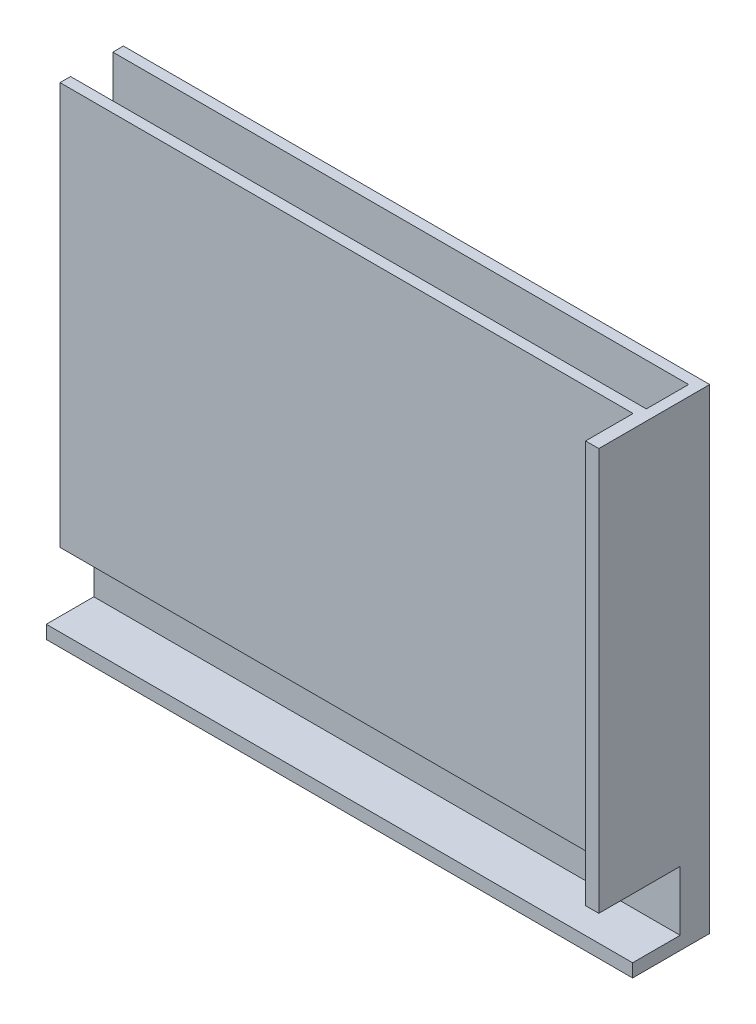
ISO-10303-21;
HEADER;
FILE_DESCRIPTION(('STEP AP214'),'2;1');
FILE_NAME('part.step','',(''),(''),'','','');
FILE_SCHEMA(('AUTOMOTIVE_DESIGN { 1 0 10303 214 1 1 1 1 }'));
ENDSEC;
DATA;
#1=APPLICATION_CONTEXT('core data for automotive mechanical design processes');
#2=APPLICATION_PROTOCOL_DEFINITION('international standard','automotive_design',2000,#1);
#3=PRODUCT_CONTEXT('',#1,'mechanical');
#4=PRODUCT('Part','Part','',(#3));
#5=PRODUCT_RELATED_PRODUCT_CATEGORY('part','',(#4));
#6=PRODUCT_DEFINITION_FORMATION('','',#4);
#7=PRODUCT_DEFINITION_CONTEXT('part definition',#1,'design');
#8=PRODUCT_DEFINITION('design','',#6,#7);
#9=PRODUCT_DEFINITION_SHAPE('','',#8);
#10=(LENGTH_UNIT() NAMED_UNIT(*) SI_UNIT(.MILLI.,.METRE.));
#11=(NAMED_UNIT(*) PLANE_ANGLE_UNIT() SI_UNIT($,.RADIAN.));
#12=(NAMED_UNIT(*) SI_UNIT($,.STERADIAN.) SOLID_ANGLE_UNIT());
#13=UNCERTAINTY_MEASURE_WITH_UNIT(LENGTH_MEASURE(1.E-05),#10,'distance_accuracy_value','');
#14=(GEOMETRIC_REPRESENTATION_CONTEXT(3) GLOBAL_UNCERTAINTY_ASSIGNED_CONTEXT((#13)) GLOBAL_UNIT_ASSIGNED_CONTEXT((#10,
#11,#12)) REPRESENTATION_CONTEXT('',''));
#15=CARTESIAN_POINT('',(0.,0.,0.));
#16=DIRECTION('',(0.,0.,1.));
#17=DIRECTION('',(1.,0.,0.));
#18=AXIS2_PLACEMENT_3D('',#15,#16,#17);
#19=CARTESIAN_POINT('',(213.576829268293,16.3396341463416,26.68));
#20=DIRECTION('',(0.,-1.,0.));
#21=DIRECTION('',(1.,0.,0.));
#22=AXIS2_PLACEMENT_3D('',#19,#20,#21);
#23=PLANE('',#22);
#24=DIRECTION('',(1.,0.,0.));
#25=VECTOR('',#24,1.);
#26=CARTESIAN_POINT('',(0.,16.3396341463416,2.54));
#27=LINE('',#26,#25);
#28=CARTESIAN_POINT('',(72.6068292682926,16.3396341463416,2.54));
#29=VERTEX_POINT('',#28);
#30=CARTESIAN_POINT('',(211.036829268293,16.3396341463416,2.54));
#31=VERTEX_POINT('',#30);
#32=EDGE_CURVE('E43',#29,#31,#27,.T.);
#33=ORIENTED_EDGE('',*,*,#32,.T.);
#34=DIRECTION('',(0.,0.,-1.));
#35=VECTOR('',#34,1.);
#36=CARTESIAN_POINT('',(211.036829268293,16.3396341463416,28.702));
#37=LINE('',#36,#35);
#38=CARTESIAN_POINT('',(211.036829268293,16.3396341463416,12.7));
#39=VERTEX_POINT('',#38);
#40=EDGE_CURVE('E240',#39,#31,#37,.T.);
#41=ORIENTED_EDGE('',*,*,#40,.F.);
#42=DIRECTION('',(-1.,0.,0.));
#43=VECTOR('',#42,1.);
#44=CARTESIAN_POINT('',(0.,16.3396341463416,12.7));
#45=LINE('',#44,#43);
#46=CARTESIAN_POINT('',(72.6068292682926,16.3396341463416,12.7));
#47=VERTEX_POINT('',#46);
#48=EDGE_CURVE('E242',#39,#47,#45,.T.);
#49=ORIENTED_EDGE('',*,*,#48,.T.);
#50=DIRECTION('',(0.,0.,-1.));
#51=VECTOR('',#50,1.);
#52=CARTESIAN_POINT('',(72.6068292682926,16.3396341463416,26.68));
#53=LINE('',#52,#51);
#54=CARTESIAN_POINT('',(72.6068292682926,16.3396341463416,15.24));
#55=VERTEX_POINT('',#54);
#56=EDGE_CURVE('E245',#55,#47,#53,.T.);
#57=ORIENTED_EDGE('',*,*,#56,.F.);
#58=DIRECTION('',(-1.,0.,0.));
#59=VECTOR('',#58,1.);
#60=CARTESIAN_POINT('',(0.,16.3396341463416,15.24));
#61=LINE('',#60,#59);
#62=CARTESIAN_POINT('',(210.401829268293,16.3396341463416,15.24));
#63=VERTEX_POINT('',#62);
#64=EDGE_CURVE('E212',#63,#55,#61,.T.);
#65=ORIENTED_EDGE('',*,*,#64,.F.);
#66=DIRECTION('',(0.,0.,1.));
#67=VECTOR('',#66,1.);
#68=CARTESIAN_POINT('',(210.401829268293,16.3396341463416,0.));
#69=LINE('',#68,#67);
#70=CARTESIAN_POINT('',(210.401829268293,16.3396341463416,26.67));
#71=VERTEX_POINT('',#70);
#72=EDGE_CURVE('E48',#63,#71,#69,.T.);
#73=ORIENTED_EDGE('',*,*,#72,.T.);
#74=DIRECTION('',(1.,0.,0.));
#75=VECTOR('',#74,1.);
#76=CARTESIAN_POINT('',(0.,16.3396341463416,26.67));
#77=LINE('',#76,#75);
#78=CARTESIAN_POINT('',(213.576829268293,16.3396341463415,26.67));
#79=VERTEX_POINT('',#78);
#80=EDGE_CURVE('E11',#71,#79,#77,.T.);
#81=ORIENTED_EDGE('',*,*,#80,.T.);
#82=DIRECTION('',(0.,0.,-1.));
#83=VECTOR('',#82,1.);
#84=CARTESIAN_POINT('',(213.576829268293,16.3396341463416,28.702));
#85=LINE('',#84,#83);
#86=CARTESIAN_POINT('',(213.576829268293,16.3396341463416,0.));
#87=VERTEX_POINT('',#86);
#88=EDGE_CURVE('E62',#79,#87,#85,.T.);
#89=ORIENTED_EDGE('',*,*,#88,.T.);
#90=DIRECTION('',(1.,0.,0.));
#91=VECTOR('',#90,1.);
#92=CARTESIAN_POINT('',(0.,16.3396341463416,0.));
#93=LINE('',#92,#91);
#94=CARTESIAN_POINT('',(72.6068292682926,16.3396341463416,0.));
#95=VERTEX_POINT('',#94);
#96=EDGE_CURVE('E238',#95,#87,#93,.T.);
#97=ORIENTED_EDGE('',*,*,#96,.F.);
#98=EDGE_CURVE('E243',#29,#95,#53,.T.);
#99=ORIENTED_EDGE('',*,*,#98,.F.);
#100=EDGE_LOOP('',(#33,#41,#49,#57,#65,#73,#81,#89,#97,#99));
#101=FACE_BOUND('',#100,.T.);
#102=ADVANCED_FACE('F40',(#101),#23,.F.);
#103=CARTESIAN_POINT('',(72.6068292682926,130.639634146342,26.68));
#104=DIRECTION('',(1.,0.,0.));
#105=DIRECTION('',(0.,1.,0.));
#106=AXIS2_PLACEMENT_3D('',#103,#104,#105);
#107=PLANE('',#106);
#108=DIRECTION('',(0.,-1.,0.));
#109=VECTOR('',#108,1.);
#110=CARTESIAN_POINT('',(72.6068292682926,0.,15.24));
#111=LINE('',#110,#109);
#112=CARTESIAN_POINT('',(72.6068292682926,-80.4343658536585,15.24));
#113=VERTEX_POINT('',#112);
#114=EDGE_CURVE('E188',#55,#113,#111,.T.);
#115=ORIENTED_EDGE('',*,*,#114,.F.);
#116=ORIENTED_EDGE('',*,*,#56,.T.);
#117=DIRECTION('',(0.,-1.,0.));
#118=VECTOR('',#117,1.);
#119=CARTESIAN_POINT('',(72.6068292682926,0.,12.7));
#120=LINE('',#119,#118);
#121=CARTESIAN_POINT('',(72.6068292682926,-77.8943658536585,12.7));
#122=VERTEX_POINT('',#121);
#123=EDGE_CURVE('E210',#47,#122,#120,.T.);
#124=ORIENTED_EDGE('',*,*,#123,.T.);
#125=DIRECTION('',(0.,0.,-1.));
#126=VECTOR('',#125,1.);
#127=CARTESIAN_POINT('',(72.6068292682926,-77.8943658536585,17.272));
#128=LINE('',#127,#126);
#129=CARTESIAN_POINT('',(72.6068292682926,-77.8943658536585,4.572));
#130=VERTEX_POINT('',#129);
#131=EDGE_CURVE('E222',#122,#130,#128,.T.);
#132=ORIENTED_EDGE('',*,*,#131,.T.);
#133=DIRECTION('',(0.,-1.,0.));
#134=VECTOR('',#133,1.);
#135=CARTESIAN_POINT('',(72.6068292682926,0.,4.572));
#136=LINE('',#135,#134);
#137=CARTESIAN_POINT('',(72.6068292682926,-95.4203658536585,4.572));
#138=VERTEX_POINT('',#137);
#139=EDGE_CURVE('E213',#130,#138,#136,.T.);
#140=ORIENTED_EDGE('',*,*,#139,.T.);
#141=DIRECTION('',(0.,0.,-1.));
#142=VECTOR('',#141,1.);
#143=CARTESIAN_POINT('',(72.6068292682926,-95.4203658536585,0.));
#144=LINE('',#143,#142);
#145=CARTESIAN_POINT('',(72.6068292682926,-95.4203658536585,2.54));
#146=VERTEX_POINT('',#145);
#147=EDGE_CURVE('E226',#138,#146,#144,.T.);
#148=ORIENTED_EDGE('',*,*,#147,.T.);
#149=DIRECTION('',(0.,1.,0.));
#150=VECTOR('',#149,1.);
#151=CARTESIAN_POINT('',(72.6068292682926,0.,2.54));
#152=LINE('',#151,#150);
#153=EDGE_CURVE('E225',#146,#29,#152,.T.);
#154=ORIENTED_EDGE('',*,*,#153,.T.);
#155=ORIENTED_EDGE('',*,*,#98,.T.);
#156=DIRECTION('',(0.,1.,0.));
#157=VECTOR('',#156,1.);
#158=CARTESIAN_POINT('',(72.6068292682926,0.,0.));
#159=LINE('',#158,#157);
#160=CARTESIAN_POINT('',(72.6068292682926,-97.9603658536585,0.));
#161=VERTEX_POINT('',#160);
#162=EDGE_CURVE('E214',#161,#95,#159,.T.);
#163=ORIENTED_EDGE('',*,*,#162,.F.);
#164=DIRECTION('',(0.,0.,-1.));
#165=VECTOR('',#164,1.);
#166=CARTESIAN_POINT('',(72.6068292682926,-97.9603658536585,0.));
#167=LINE('',#166,#165);
#168=CARTESIAN_POINT('',(72.6068292682926,-97.9603658536585,18.542));
#169=VERTEX_POINT('',#168);
#170=EDGE_CURVE('E219',#169,#161,#167,.T.);
#171=ORIENTED_EDGE('',*,*,#170,.F.);
#172=DIRECTION('',(0.,1.,0.));
#173=VECTOR('',#172,1.);
#174=CARTESIAN_POINT('',(72.6068292682926,0.,18.542));
#175=LINE('',#174,#173);
#176=CARTESIAN_POINT('',(72.6068292682926,-94.7853658536585,18.542));
#177=VERTEX_POINT('',#176);
#178=EDGE_CURVE('E160',#169,#177,#175,.T.);
#179=ORIENTED_EDGE('',*,*,#178,.T.);
#180=DIRECTION('',(0.,0.,-1.));
#181=VECTOR('',#180,1.);
#182=CARTESIAN_POINT('',(72.6068292682926,-94.7853658536585,0.));
#183=LINE('',#182,#181);
#184=CARTESIAN_POINT('',(72.6068292682926,-94.7853658536585,7.112));
#185=VERTEX_POINT('',#184);
#186=EDGE_CURVE('E221',#177,#185,#183,.T.);
#187=ORIENTED_EDGE('',*,*,#186,.T.);
#188=DIRECTION('',(0.,-1.,0.));
#189=VECTOR('',#188,1.);
#190=CARTESIAN_POINT('',(72.6068292682926,0.,7.112));
#191=LINE('',#190,#189);
#192=CARTESIAN_POINT('',(72.6068292682926,-80.4343658536585,7.112));
#193=VERTEX_POINT('',#192);
#194=EDGE_CURVE('E218',#193,#185,#191,.T.);
#195=ORIENTED_EDGE('',*,*,#194,.F.);
#196=DIRECTION('',(0.,0.,-1.));
#197=VECTOR('',#196,1.);
#198=CARTESIAN_POINT('',(72.6068292682926,-80.4343658536585,17.272));
#199=LINE('',#198,#197);
#200=EDGE_CURVE('E217',#113,#193,#199,.T.);
#201=ORIENTED_EDGE('',*,*,#200,.F.);
#202=EDGE_LOOP('',(#115,#116,#124,#132,#140,#148,#154,#155,#163,#171,#179,#187,#195,#201));
#203=FACE_BOUND('',#202,.T.);
#204=ADVANCED_FACE('F282',(#203),#107,.F.);
#205=CARTESIAN_POINT('',(211.036829268293,-94.7853658536585,28.702));
#206=DIRECTION('',(1.,0.,0.));
#207=DIRECTION('',(0.,0.,-1.));
#208=AXIS2_PLACEMENT_3D('',#205,#206,#207);
#209=PLANE('',#208);
#210=DIRECTION('',(0.,-1.,0.));
#211=VECTOR('',#210,1.);
#212=CARTESIAN_POINT('',(211.036829268293,0.,12.7));
#213=LINE('',#212,#211);
#214=CARTESIAN_POINT('',(211.036829268293,-77.8943658536585,12.7));
#215=VERTEX_POINT('',#214);
#216=EDGE_CURVE('E181',#39,#215,#213,.T.);
#217=ORIENTED_EDGE('',*,*,#216,.F.);
#218=ORIENTED_EDGE('',*,*,#40,.T.);
#219=DIRECTION('',(0.,1.,0.));
#220=VECTOR('',#219,1.);
#221=CARTESIAN_POINT('',(211.036829268293,0.,2.54));
#222=LINE('',#221,#220);
#223=CARTESIAN_POINT('',(211.036829268293,-95.4203658536585,2.54));
#224=VERTEX_POINT('',#223);
#225=EDGE_CURVE('E206',#224,#31,#222,.T.);
#226=ORIENTED_EDGE('',*,*,#225,.F.);
#227=DIRECTION('',(0.,0.,1.));
#228=VECTOR('',#227,1.);
#229=CARTESIAN_POINT('',(211.036829268293,-95.4203658536585,28.702));
#230=LINE('',#229,#228);
#231=CARTESIAN_POINT('',(211.036829268293,-95.4203658536585,4.572));
#232=VERTEX_POINT('',#231);
#233=EDGE_CURVE('E203',#224,#232,#230,.T.);
#234=ORIENTED_EDGE('',*,*,#233,.T.);
#235=DIRECTION('',(0.,1.,0.));
#236=VECTOR('',#235,1.);
#237=CARTESIAN_POINT('',(211.036829268293,-94.7853658536585,4.572));
#238=LINE('',#237,#236);
#239=CARTESIAN_POINT('',(211.036829268293,-77.8943658536585,4.572));
#240=VERTEX_POINT('',#239);
#241=EDGE_CURVE('E192',#232,#240,#238,.T.);
#242=ORIENTED_EDGE('',*,*,#241,.T.);
#243=DIRECTION('',(0.,0.,1.));
#244=VECTOR('',#243,1.);
#245=CARTESIAN_POINT('',(211.036829268293,-77.8943658536585,28.702));
#246=LINE('',#245,#244);
#247=EDGE_CURVE('E195',#240,#215,#246,.T.);
#248=ORIENTED_EDGE('',*,*,#247,.T.);
#249=EDGE_LOOP('',(#217,#218,#226,#234,#242,#248));
#250=FACE_BOUND('',#249,.T.);
#251=ADVANCED_FACE('F254',(#250),#209,.F.);
#252=CARTESIAN_POINT('',(0.,-95.4203658536585,0.));
#253=DIRECTION('',(0.,1.,0.));
#254=DIRECTION('',(0.,0.,1.));
#255=AXIS2_PLACEMENT_3D('',#252,#253,#254);
#256=PLANE('',#255);
#257=ORIENTED_EDGE('',*,*,#147,.F.);
#258=DIRECTION('',(-1.,0.,0.));
#259=VECTOR('',#258,1.);
#260=CARTESIAN_POINT('',(0.,-95.4203658536585,4.572));
#261=LINE('',#260,#259);
#262=EDGE_CURVE('E200',#232,#138,#261,.T.);
#263=ORIENTED_EDGE('',*,*,#262,.F.);
#264=ORIENTED_EDGE('',*,*,#233,.F.);
#265=DIRECTION('',(1.,0.,0.));
#266=VECTOR('',#265,1.);
#267=CARTESIAN_POINT('',(0.,-95.4203658536585,2.54));
#268=LINE('',#267,#266);
#269=EDGE_CURVE('E198',#146,#224,#268,.T.);
#270=ORIENTED_EDGE('',*,*,#269,.F.);
#271=EDGE_LOOP('',(#257,#263,#264,#270));
#272=FACE_BOUND('',#271,.T.);
#273=ADVANCED_FACE('F264',(#272),#256,.T.);
#274=CARTESIAN_POINT('',(-68.3631707317074,-77.8943658536585,17.272));
#275=DIRECTION('',(0.,1.,0.));
#276=DIRECTION('',(0.,0.,1.));
#277=AXIS2_PLACEMENT_3D('',#274,#275,#276);
#278=PLANE('',#277);
#279=ORIENTED_EDGE('',*,*,#131,.F.);
#280=DIRECTION('',(1.,0.,0.));
#281=VECTOR('',#280,1.);
#282=CARTESIAN_POINT('',(0.,-77.8943658536585,12.7));
#283=LINE('',#282,#281);
#284=EDGE_CURVE('E185',#122,#215,#283,.T.);
#285=ORIENTED_EDGE('',*,*,#284,.T.);
#286=ORIENTED_EDGE('',*,*,#247,.F.);
#287=DIRECTION('',(-1.,0.,0.));
#288=VECTOR('',#287,1.);
#289=CARTESIAN_POINT('',(-68.3631707317074,-77.8943658536585,4.572));
#290=LINE('',#289,#288);
#291=EDGE_CURVE('E189',#240,#130,#290,.T.);
#292=ORIENTED_EDGE('',*,*,#291,.T.);
#293=EDGE_LOOP('',(#279,#285,#286,#292));
#294=FACE_BOUND('',#293,.T.);
#295=ADVANCED_FACE('F271',(#294),#278,.T.);
#296=CARTESIAN_POINT('',(0.,0.,2.54));
#297=DIRECTION('',(0.,0.,1.));
#298=DIRECTION('',(1.,0.,0.));
#299=AXIS2_PLACEMENT_3D('',#296,#297,#298);
#300=PLANE('',#299);
#301=ORIENTED_EDGE('',*,*,#32,.F.);
#302=ORIENTED_EDGE('',*,*,#153,.F.);
#303=ORIENTED_EDGE('',*,*,#269,.T.);
#304=ORIENTED_EDGE('',*,*,#225,.T.);
#305=EDGE_LOOP('',(#301,#302,#303,#304));
#306=FACE_BOUND('',#305,.T.);
#307=ADVANCED_FACE('F259',(#306),#300,.T.);
#308=CARTESIAN_POINT('',(0.,0.,4.572));
#309=DIRECTION('',(0.,0.,-1.));
#310=DIRECTION('',(-1.,0.,0.));
#311=AXIS2_PLACEMENT_3D('',#308,#309,#310);
#312=PLANE('',#311);
#313=ORIENTED_EDGE('',*,*,#139,.F.);
#314=ORIENTED_EDGE('',*,*,#291,.F.);
#315=ORIENTED_EDGE('',*,*,#241,.F.);
#316=ORIENTED_EDGE('',*,*,#262,.T.);
#317=EDGE_LOOP('',(#313,#314,#315,#316));
#318=FACE_BOUND('',#317,.T.);
#319=ADVANCED_FACE('F268',(#318),#312,.T.);
#320=CARTESIAN_POINT('',(0.,0.,12.7));
#321=DIRECTION('',(0.,0.,-1.));
#322=DIRECTION('',(-1.,0.,0.));
#323=AXIS2_PLACEMENT_3D('',#320,#321,#322);
#324=PLANE('',#323);
#325=ORIENTED_EDGE('',*,*,#48,.F.);
#326=ORIENTED_EDGE('',*,*,#216,.T.);
#327=ORIENTED_EDGE('',*,*,#284,.F.);
#328=ORIENTED_EDGE('',*,*,#123,.F.);
#329=EDGE_LOOP('',(#325,#326,#327,#328));
#330=FACE_BOUND('',#329,.T.);
#331=ADVANCED_FACE('F275',(#330),#324,.T.);
#332=CARTESIAN_POINT('',(213.576829268293,-94.7853658536585,28.702));
#333=DIRECTION('',(1.,0.,0.));
#334=DIRECTION('',(0.,0.,-1.));
#335=AXIS2_PLACEMENT_3D('',#332,#333,#334);
#336=PLANE('',#335);
#337=ORIENTED_EDGE('',*,*,#88,.F.);
#338=DIRECTION('',(0.,1.,0.));
#339=VECTOR('',#338,1.);
#340=CARTESIAN_POINT('',(213.576829268293,-80.4343658536585,26.67));
#341=LINE('',#340,#339);
#342=CARTESIAN_POINT('',(213.576829268293,-80.4343658536585,26.67));
#343=VERTEX_POINT('',#342);
#344=EDGE_CURVE('E298',#343,#79,#341,.T.);
#345=ORIENTED_EDGE('',*,*,#344,.F.);
#346=DIRECTION('',(0.,0.,1.));
#347=VECTOR('',#346,1.);
#348=CARTESIAN_POINT('',(213.576829268293,-80.4343658536585,17.272));
#349=LINE('',#348,#347);
#350=CARTESIAN_POINT('',(213.576829268293,-80.4343658536585,7.112));
#351=VERTEX_POINT('',#350);
#352=EDGE_CURVE('E308',#351,#343,#349,.T.);
#353=ORIENTED_EDGE('',*,*,#352,.F.);
#354=DIRECTION('',(0.,1.,0.));
#355=VECTOR('',#354,1.);
#356=CARTESIAN_POINT('',(213.576829268293,-80.4343658536585,7.112));
#357=LINE('',#356,#355);
#358=CARTESIAN_POINT('',(213.576829268293,-94.7853658536585,7.112));
#359=VERTEX_POINT('',#358);
#360=EDGE_CURVE('E303',#359,#351,#357,.T.);
#361=ORIENTED_EDGE('',*,*,#360,.F.);
#362=DIRECTION('',(0.,0.,1.));
#363=VECTOR('',#362,1.);
#364=CARTESIAN_POINT('',(213.576829268293,-94.7853658536585,28.702));
#365=LINE('',#364,#363);
#366=CARTESIAN_POINT('',(213.576829268293,-94.7853658536585,18.542));
#367=VERTEX_POINT('',#366);
#368=EDGE_CURVE('E173',#359,#367,#365,.T.);
#369=ORIENTED_EDGE('',*,*,#368,.T.);
#370=DIRECTION('',(0.,1.,0.));
#371=VECTOR('',#370,1.);
#372=CARTESIAN_POINT('',(213.576829268293,-97.9603658536585,18.542));
#373=LINE('',#372,#371);
#374=CARTESIAN_POINT('',(213.576829268293,-97.9603658536585,18.542));
#375=VERTEX_POINT('',#374);
#376=EDGE_CURVE('E157',#375,#367,#373,.T.);
#377=ORIENTED_EDGE('',*,*,#376,.F.);
#378=DIRECTION('',(0.,0.,1.));
#379=VECTOR('',#378,1.);
#380=CARTESIAN_POINT('',(213.576829268293,-97.9603658536585,28.702));
#381=LINE('',#380,#379);
#382=CARTESIAN_POINT('',(213.576829268293,-97.9603658536585,0.));
#383=VERTEX_POINT('',#382);
#384=EDGE_CURVE('E169',#383,#375,#381,.T.);
#385=ORIENTED_EDGE('',*,*,#384,.F.);
#386=DIRECTION('',(0.,1.,0.));
#387=VECTOR('',#386,1.);
#388=CARTESIAN_POINT('',(213.576829268293,130.639634146342,0.));
#389=LINE('',#388,#387);
#390=EDGE_CURVE('E179',#383,#87,#389,.T.);
#391=ORIENTED_EDGE('',*,*,#390,.T.);
#392=EDGE_LOOP('',(#337,#345,#353,#361,#369,#377,#385,#391));
#393=FACE_BOUND('',#392,.T.);
#394=ADVANCED_FACE('F168',(#393),#336,.T.);
#395=CARTESIAN_POINT('',(0.,-94.7853658536585,0.));
#396=DIRECTION('',(0.,1.,0.));
#397=DIRECTION('',(0.,0.,1.));
#398=AXIS2_PLACEMENT_3D('',#395,#396,#397);
#399=PLANE('',#398);
#400=ORIENTED_EDGE('',*,*,#186,.F.);
#401=DIRECTION('',(-1.,0.,0.));
#402=VECTOR('',#401,1.);
#403=CARTESIAN_POINT('',(213.576829268293,-94.7853658536585,18.542));
#404=LINE('',#403,#402);
#405=EDGE_CURVE('E164',#367,#177,#404,.T.);
#406=ORIENTED_EDGE('',*,*,#405,.F.);
#407=ORIENTED_EDGE('',*,*,#368,.F.);
#408=DIRECTION('',(1.,0.,0.));
#409=VECTOR('',#408,1.);
#410=CARTESIAN_POINT('',(213.576829268293,-94.7853658536585,7.112));
#411=LINE('',#410,#409);
#412=EDGE_CURVE('E296',#185,#359,#411,.T.);
#413=ORIENTED_EDGE('',*,*,#412,.F.);
#414=EDGE_LOOP('',(#400,#406,#407,#413));
#415=FACE_BOUND('',#414,.T.);
#416=ADVANCED_FACE('F320',(#415),#399,.T.);
#417=CARTESIAN_POINT('',(0.,-97.9603658536585,0.));
#418=DIRECTION('',(0.,1.,0.));
#419=DIRECTION('',(0.,0.,1.));
#420=AXIS2_PLACEMENT_3D('',#417,#418,#419);
#421=PLANE('',#420);
#422=DIRECTION('',(1.,0.,0.));
#423=VECTOR('',#422,1.);
#424=CARTESIAN_POINT('',(-68.3631707317073,-97.9603658536585,18.542));
#425=LINE('',#424,#423);
#426=EDGE_CURVE('E153',#169,#375,#425,.T.);
#427=ORIENTED_EDGE('',*,*,#426,.F.);
#428=ORIENTED_EDGE('',*,*,#170,.T.);
#429=DIRECTION('',(1.,0.,0.));
#430=VECTOR('',#429,1.);
#431=CARTESIAN_POINT('',(-68.3631707317073,-97.9603658536585,0.));
#432=LINE('',#431,#430);
#433=EDGE_CURVE('E178',#161,#383,#432,.T.);
#434=ORIENTED_EDGE('',*,*,#433,.T.);
#435=ORIENTED_EDGE('',*,*,#384,.T.);
#436=EDGE_LOOP('',(#427,#428,#434,#435));
#437=FACE_BOUND('',#436,.T.);
#438=ADVANCED_FACE('F176',(#437),#421,.F.);
#439=CARTESIAN_POINT('',(-68.3631707317074,-80.4343658536585,17.272));
#440=DIRECTION('',(0.,1.,0.));
#441=DIRECTION('',(0.,0.,1.));
#442=AXIS2_PLACEMENT_3D('',#439,#440,#441);
#443=PLANE('',#442);
#444=DIRECTION('',(1.,0.,0.));
#445=VECTOR('',#444,1.);
#446=CARTESIAN_POINT('',(210.401829268293,-80.4343658536585,15.24));
#447=LINE('',#446,#445);
#448=CARTESIAN_POINT('',(210.401829268293,-80.4343658536585,15.24));
#449=VERTEX_POINT('',#448);
#450=EDGE_CURVE('E287',#113,#449,#447,.T.);
#451=ORIENTED_EDGE('',*,*,#450,.F.);
#452=ORIENTED_EDGE('',*,*,#200,.T.);
#453=DIRECTION('',(-1.,0.,0.));
#454=VECTOR('',#453,1.);
#455=CARTESIAN_POINT('',(-68.3631707317074,-80.4343658536585,7.112));
#456=LINE('',#455,#454);
#457=EDGE_CURVE('E293',#351,#193,#456,.T.);
#458=ORIENTED_EDGE('',*,*,#457,.F.);
#459=ORIENTED_EDGE('',*,*,#352,.T.);
#460=DIRECTION('',(1.,0.,0.));
#461=VECTOR('',#460,1.);
#462=CARTESIAN_POINT('',(210.401829268293,-80.4343658536585,26.67));
#463=LINE('',#462,#461);
#464=CARTESIAN_POINT('',(210.401829268293,-80.4343658536585,26.67));
#465=VERTEX_POINT('',#464);
#466=EDGE_CURVE('E315',#465,#343,#463,.T.);
#467=ORIENTED_EDGE('',*,*,#466,.F.);
#468=DIRECTION('',(0.,0.,-1.));
#469=VECTOR('',#468,1.);
#470=CARTESIAN_POINT('',(210.401829268293,-80.4343658536585,25.4));
#471=LINE('',#470,#469);
#472=EDGE_CURVE('E306',#465,#449,#471,.T.);
#473=ORIENTED_EDGE('',*,*,#472,.T.);
#474=EDGE_LOOP('',(#451,#452,#458,#459,#467,#473));
#475=FACE_BOUND('',#474,.T.);
#476=ADVANCED_FACE('F314',(#475),#443,.F.);
#477=CARTESIAN_POINT('',(210.401829268293,0.,0.));
#478=DIRECTION('',(-1.,0.,0.));
#479=DIRECTION('',(0.,0.,1.));
#480=AXIS2_PLACEMENT_3D('',#477,#478,#479);
#481=PLANE('',#480);
#482=ORIENTED_EDGE('',*,*,#72,.F.);
#483=DIRECTION('',(0.,1.,0.));
#484=VECTOR('',#483,1.);
#485=CARTESIAN_POINT('',(210.401829268293,127.464634146342,15.24));
#486=LINE('',#485,#484);
#487=EDGE_CURVE('E290',#449,#63,#486,.T.);
#488=ORIENTED_EDGE('',*,*,#487,.F.);
#489=ORIENTED_EDGE('',*,*,#472,.F.);
#490=DIRECTION('',(0.,-1.,0.));
#491=VECTOR('',#490,1.);
#492=CARTESIAN_POINT('',(210.401829268293,127.464634146342,26.67));
#493=LINE('',#492,#491);
#494=EDGE_CURVE('E174',#71,#465,#493,.T.);
#495=ORIENTED_EDGE('',*,*,#494,.F.);
#496=EDGE_LOOP('',(#482,#488,#489,#495));
#497=FACE_BOUND('',#496,.T.);
#498=ADVANCED_FACE('F326',(#497),#481,.T.);
#499=CARTESIAN_POINT('',(0.,0.,0.));
#500=DIRECTION('',(0.,0.,1.));
#501=DIRECTION('',(1.,0.,0.));
#502=AXIS2_PLACEMENT_3D('',#499,#500,#501);
#503=PLANE('',#502);
#504=ORIENTED_EDGE('',*,*,#162,.T.);
#505=ORIENTED_EDGE('',*,*,#96,.T.);
#506=ORIENTED_EDGE('',*,*,#390,.F.);
#507=ORIENTED_EDGE('',*,*,#433,.F.);
#508=EDGE_LOOP('',(#504,#505,#506,#507));
#509=FACE_BOUND('',#508,.T.);
#510=ADVANCED_FACE('F324',(#509),#503,.F.);
#511=CARTESIAN_POINT('',(0.,0.,7.112));
#512=DIRECTION('',(0.,0.,-1.));
#513=DIRECTION('',(-1.,0.,0.));
#514=AXIS2_PLACEMENT_3D('',#511,#512,#513);
#515=PLANE('',#514);
#516=ORIENTED_EDGE('',*,*,#457,.T.);
#517=ORIENTED_EDGE('',*,*,#194,.T.);
#518=ORIENTED_EDGE('',*,*,#412,.T.);
#519=ORIENTED_EDGE('',*,*,#360,.T.);
#520=EDGE_LOOP('',(#516,#517,#518,#519));
#521=FACE_BOUND('',#520,.T.);
#522=ADVANCED_FACE('F335',(#521),#515,.F.);
#523=CARTESIAN_POINT('',(0.,0.,15.24));
#524=DIRECTION('',(0.,0.,-1.));
#525=DIRECTION('',(-1.,0.,0.));
#526=AXIS2_PLACEMENT_3D('',#523,#524,#525);
#527=PLANE('',#526);
#528=ORIENTED_EDGE('',*,*,#487,.T.);
#529=ORIENTED_EDGE('',*,*,#64,.T.);
#530=ORIENTED_EDGE('',*,*,#114,.T.);
#531=ORIENTED_EDGE('',*,*,#450,.T.);
#532=EDGE_LOOP('',(#528,#529,#530,#531));
#533=FACE_BOUND('',#532,.T.);
#534=ADVANCED_FACE('F286',(#533),#527,.F.);
#535=CARTESIAN_POINT('',(0.,0.,26.67));
#536=DIRECTION('',(0.,0.,1.));
#537=DIRECTION('',(1.,0.,0.));
#538=AXIS2_PLACEMENT_3D('',#535,#536,#537);
#539=PLANE('',#538);
#540=ORIENTED_EDGE('',*,*,#80,.F.);
#541=ORIENTED_EDGE('',*,*,#494,.T.);
#542=ORIENTED_EDGE('',*,*,#466,.T.);
#543=ORIENTED_EDGE('',*,*,#344,.T.);
#544=EDGE_LOOP('',(#540,#541,#542,#543));
#545=FACE_BOUND('',#544,.T.);
#546=ADVANCED_FACE('F327',(#545),#539,.T.);
#547=CARTESIAN_POINT('',(0.,0.,18.542));
#548=DIRECTION('',(0.,0.,1.));
#549=DIRECTION('',(1.,0.,0.));
#550=AXIS2_PLACEMENT_3D('',#547,#548,#549);
#551=PLANE('',#550);
#552=ORIENTED_EDGE('',*,*,#178,.F.);
#553=ORIENTED_EDGE('',*,*,#426,.T.);
#554=ORIENTED_EDGE('',*,*,#376,.T.);
#555=ORIENTED_EDGE('',*,*,#405,.T.);
#556=EDGE_LOOP('',(#552,#553,#554,#555));
#557=FACE_BOUND('',#556,.T.);
#558=ADVANCED_FACE('F155',(#557),#551,.T.);
#559=CLOSED_SHELL('',(#102,#204,#251,#273,#295,#307,#319,#331,#394,#416,#438,#476,#498,#510,
#522,#534,#546,#558));
#560=MANIFOLD_SOLID_BREP('B2',#559);
#561=ADVANCED_BREP_SHAPE_REPRESENTATION('',(#18,#560),#14);
#562=SHAPE_DEFINITION_REPRESENTATION(#9,#561);
ENDSEC;
END-ISO-10303-21;
